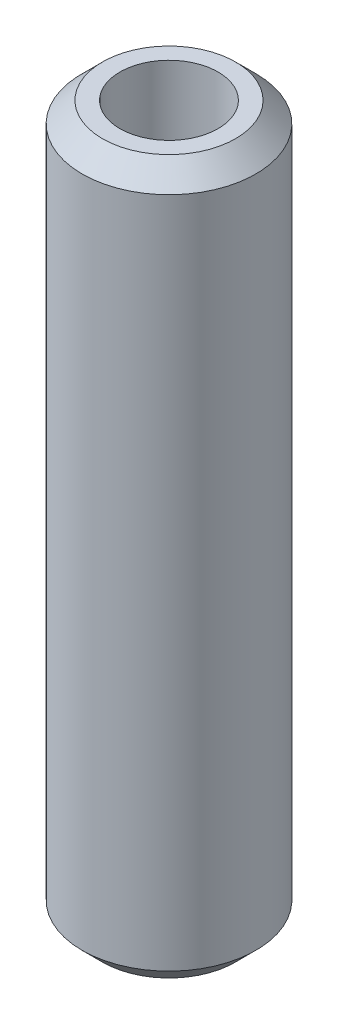
ISO-10303-21;
HEADER;
FILE_DESCRIPTION(('STEP AP214'),'2;1');
FILE_NAME('part.step','',(''),(''),'','','');
FILE_SCHEMA(('AUTOMOTIVE_DESIGN { 1 0 10303 214 1 1 1 1 }'));
ENDSEC;
DATA;
#1=APPLICATION_CONTEXT('core data for automotive mechanical design processes');
#2=APPLICATION_PROTOCOL_DEFINITION('international standard','automotive_design',2000,#1);
#3=PRODUCT_CONTEXT('',#1,'mechanical');
#4=PRODUCT('Part','Part','',(#3));
#5=PRODUCT_RELATED_PRODUCT_CATEGORY('part','',(#4));
#6=PRODUCT_DEFINITION_FORMATION('','',#4);
#7=PRODUCT_DEFINITION_CONTEXT('part definition',#1,'design');
#8=PRODUCT_DEFINITION('design','',#6,#7);
#9=PRODUCT_DEFINITION_SHAPE('','',#8);
#10=(LENGTH_UNIT() NAMED_UNIT(*) SI_UNIT(.MILLI.,.METRE.));
#11=(NAMED_UNIT(*) PLANE_ANGLE_UNIT() SI_UNIT($,.RADIAN.));
#12=(NAMED_UNIT(*) SI_UNIT($,.STERADIAN.) SOLID_ANGLE_UNIT());
#13=UNCERTAINTY_MEASURE_WITH_UNIT(LENGTH_MEASURE(1.E-05),#10,'distance_accuracy_value','');
#14=(GEOMETRIC_REPRESENTATION_CONTEXT(3) GLOBAL_UNCERTAINTY_ASSIGNED_CONTEXT((#13)) GLOBAL_UNIT_ASSIGNED_CONTEXT((#10,
#11,#12)) REPRESENTATION_CONTEXT('',''));
#15=CARTESIAN_POINT('',(0.,0.,0.));
#16=DIRECTION('',(0.,0.,1.));
#17=DIRECTION('',(1.,0.,0.));
#18=AXIS2_PLACEMENT_3D('',#15,#16,#17);
#19=CARTESIAN_POINT('',(0.,205.179860330591,0.));
#20=DIRECTION('',(0.,-1.,0.));
#21=DIRECTION('',(0.,0.,-1.));
#22=AXIS2_PLACEMENT_3D('',#19,#20,#21);
#23=CYLINDRICAL_SURFACE('',#22,25.);
#24=CARTESIAN_POINT('',(0.,199.324566921478,0.));
#25=DIRECTION('',(0.,1.,0.));
#26=DIRECTION('',(0.,0.,1.));
#27=AXIS2_PLACEMENT_3D('',#24,#25,#26);
#28=CIRCLE('',#27,25.);
#29=CARTESIAN_POINT('',(0.,199.324566921478,25.));
#30=VERTEX_POINT('',#29);
#31=EDGE_CURVE('E50',#30,#30,#28,.F.);
#32=ORIENTED_EDGE('',*,*,#31,.T.);
#33=EDGE_LOOP('',(#32));
#34=FACE_BOUND('',#33,.T.);
#35=CARTESIAN_POINT('',(0.,5.85529340911345,0.));
#36=DIRECTION('',(0.,1.,0.));
#37=DIRECTION('',(0.,0.,1.));
#38=AXIS2_PLACEMENT_3D('',#35,#36,#37);
#39=CIRCLE('',#38,25.);
#40=CARTESIAN_POINT('',(0.,5.85529340911345,25.));
#41=VERTEX_POINT('',#40);
#42=EDGE_CURVE('E51',#41,#41,#39,.T.);
#43=ORIENTED_EDGE('',*,*,#42,.T.);
#44=EDGE_LOOP('',(#43));
#45=FACE_BOUND('',#44,.T.);
#46=ADVANCED_FACE('F39',(#34,#45),#23,.T.);
#47=CARTESIAN_POINT('',(0.,205.179860330591,0.));
#48=DIRECTION('',(0.,1.,0.));
#49=DIRECTION('',(0.,0.,1.));
#50=AXIS2_PLACEMENT_3D('',#47,#48,#49);
#51=PLANE('',#50);
#52=CARTESIAN_POINT('',(0.,205.179860330591,0.));
#53=DIRECTION('',(0.,1.,0.));
#54=DIRECTION('',(0.,0.,1.));
#55=AXIS2_PLACEMENT_3D('',#52,#53,#54);
#56=CIRCLE('',#55,19.1447065908866);
#57=CARTESIAN_POINT('',(0.,205.179860330591,19.1447065908866));
#58=VERTEX_POINT('',#57);
#59=EDGE_CURVE('E54',#58,#58,#56,.T.);
#60=ORIENTED_EDGE('',*,*,#59,.T.);
#61=EDGE_LOOP('',(#60));
#62=FACE_BOUND('',#61,.T.);
#63=CARTESIAN_POINT('',(0.,205.179860330591,0.));
#64=DIRECTION('',(0.,1.,0.));
#65=DIRECTION('',(0.,0.,1.));
#66=AXIS2_PLACEMENT_3D('',#63,#64,#65);
#67=CIRCLE('',#66,14.1291881179916);
#68=CARTESIAN_POINT('',(0.,205.179860330591,14.1291881179916));
#69=VERTEX_POINT('',#68);
#70=EDGE_CURVE('E58',#69,#69,#67,.T.);
#71=ORIENTED_EDGE('',*,*,#70,.F.);
#72=EDGE_LOOP('',(#71));
#73=FACE_BOUND('',#72,.T.);
#74=ADVANCED_FACE('F69',(#62,#73),#51,.T.);
#75=CARTESIAN_POINT('',(0.,0.,0.));
#76=DIRECTION('',(0.,1.,0.));
#77=DIRECTION('',(0.,0.,1.));
#78=AXIS2_PLACEMENT_3D('',#75,#76,#77);
#79=PLANE('',#78);
#80=CARTESIAN_POINT('',(0.,0.,0.));
#81=DIRECTION('',(0.,1.,0.));
#82=DIRECTION('',(0.,0.,1.));
#83=AXIS2_PLACEMENT_3D('',#80,#81,#82);
#84=CIRCLE('',#83,19.1447065908865);
#85=CARTESIAN_POINT('',(0.,0.,19.1447065908865));
#86=VERTEX_POINT('',#85);
#87=EDGE_CURVE('E10',#86,#86,#84,.F.);
#88=ORIENTED_EDGE('',*,*,#87,.T.);
#89=EDGE_LOOP('',(#88));
#90=FACE_BOUND('',#89,.T.);
#91=CARTESIAN_POINT('',(0.,0.,0.));
#92=DIRECTION('',(0.,1.,0.));
#93=DIRECTION('',(0.,0.,1.));
#94=AXIS2_PLACEMENT_3D('',#91,#92,#93);
#95=CIRCLE('',#94,14.1291881179916);
#96=CARTESIAN_POINT('',(0.,0.,14.1291881179916));
#97=VERTEX_POINT('',#96);
#98=EDGE_CURVE('E63',#97,#97,#95,.T.);
#99=ORIENTED_EDGE('',*,*,#98,.T.);
#100=EDGE_LOOP('',(#99));
#101=FACE_BOUND('',#100,.T.);
#102=ADVANCED_FACE('F75',(#90,#101),#79,.F.);
#103=CARTESIAN_POINT('',(0.,205.179860330591,0.));
#104=DIRECTION('',(0.,-1.,0.));
#105=DIRECTION('',(0.,0.,-1.));
#106=AXIS2_PLACEMENT_3D('',#103,#104,#105);
#107=CYLINDRICAL_SURFACE('',#106,14.1291881179916);
#108=ORIENTED_EDGE('',*,*,#70,.T.);
#109=EDGE_LOOP('',(#108));
#110=FACE_BOUND('',#109,.T.);
#111=ORIENTED_EDGE('',*,*,#98,.F.);
#112=EDGE_LOOP('',(#111));
#113=FACE_BOUND('',#112,.T.);
#114=ADVANCED_FACE('F70',(#110,#113),#107,.F.);
#115=CARTESIAN_POINT('',(0.,205.179860330591,0.));
#116=DIRECTION('',(0.,-1.,0.));
#117=DIRECTION('',(0.,0.,-1.));
#118=AXIS2_PLACEMENT_3D('',#115,#116,#117);
#119=CONICAL_SURFACE('',#118,19.1447065908866,0.785398163397442);
#120=ORIENTED_EDGE('',*,*,#31,.F.);
#121=EDGE_LOOP('',(#120));
#122=FACE_BOUND('',#121,.T.);
#123=ORIENTED_EDGE('',*,*,#59,.F.);
#124=EDGE_LOOP('',(#123));
#125=FACE_BOUND('',#124,.T.);
#126=ADVANCED_FACE('F81',(#122,#125),#119,.T.);
#127=CARTESIAN_POINT('',(0.,5.85529340911345,0.));
#128=DIRECTION('',(0.,1.,0.));
#129=DIRECTION('',(0.,0.,1.));
#130=AXIS2_PLACEMENT_3D('',#127,#128,#129);
#131=CONICAL_SURFACE('',#130,25.,0.785398163397451);
#132=ORIENTED_EDGE('',*,*,#87,.F.);
#133=EDGE_LOOP('',(#132));
#134=FACE_BOUND('',#133,.T.);
#135=ORIENTED_EDGE('',*,*,#42,.F.);
#136=EDGE_LOOP('',(#135));
#137=FACE_BOUND('',#136,.T.);
#138=ADVANCED_FACE('F45',(#134,#137),#131,.T.);
#139=CLOSED_SHELL('',(#46,#74,#102,#114,#126,#138));
#140=MANIFOLD_SOLID_BREP('B2',#139);
#141=ADVANCED_BREP_SHAPE_REPRESENTATION('',(#18,#140),#14);
#142=SHAPE_DEFINITION_REPRESENTATION(#9,#141);
ENDSEC;
END-ISO-10303-21;
